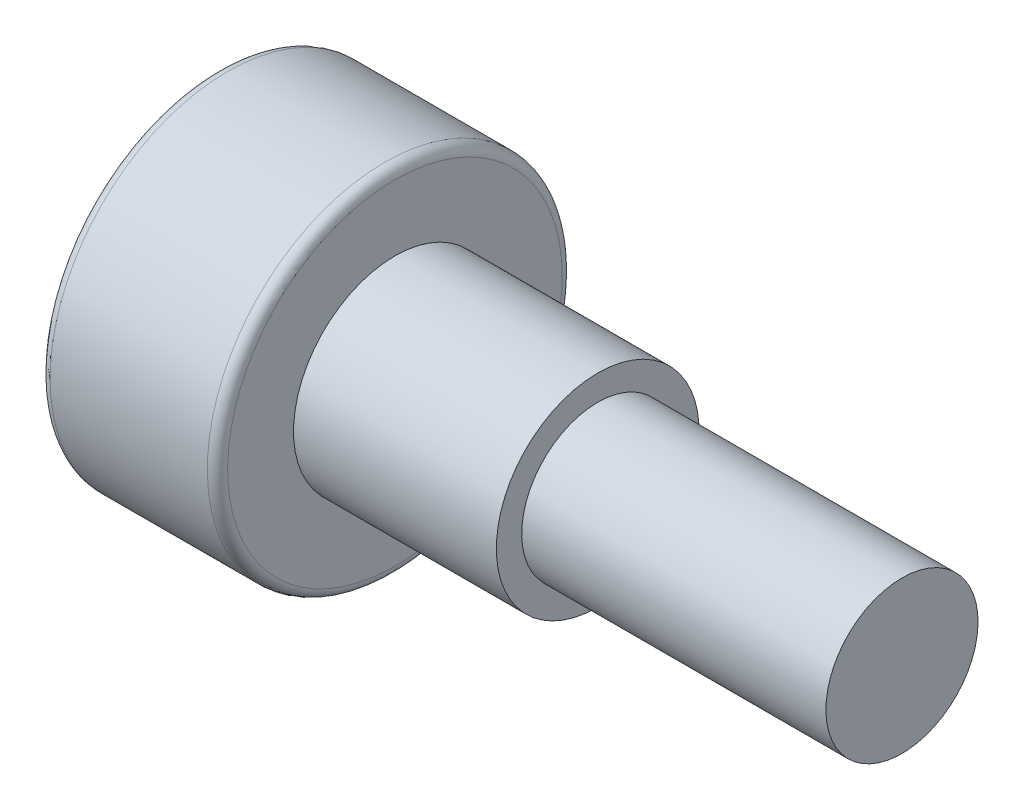
ISO-10303-21;
HEADER;
FILE_DESCRIPTION(('STEP AP214'),'2;1');
FILE_NAME('part.step','',(''),(''),'','','');
FILE_SCHEMA(('AUTOMOTIVE_DESIGN { 1 0 10303 214 1 1 1 1 }'));
ENDSEC;
DATA;
#1=APPLICATION_CONTEXT('core data for automotive mechanical design processes');
#2=APPLICATION_PROTOCOL_DEFINITION('international standard','automotive_design',2000,#1);
#3=PRODUCT_CONTEXT('',#1,'mechanical');
#4=PRODUCT('Part','Part','',(#3));
#5=PRODUCT_RELATED_PRODUCT_CATEGORY('part','',(#4));
#6=PRODUCT_DEFINITION_FORMATION('','',#4);
#7=PRODUCT_DEFINITION_CONTEXT('part definition',#1,'design');
#8=PRODUCT_DEFINITION('design','',#6,#7);
#9=PRODUCT_DEFINITION_SHAPE('','',#8);
#10=(LENGTH_UNIT() NAMED_UNIT(*) SI_UNIT(.MILLI.,.METRE.));
#11=(NAMED_UNIT(*) PLANE_ANGLE_UNIT() SI_UNIT($,.RADIAN.));
#12=(NAMED_UNIT(*) SI_UNIT($,.STERADIAN.) SOLID_ANGLE_UNIT());
#13=UNCERTAINTY_MEASURE_WITH_UNIT(LENGTH_MEASURE(1.E-05),#10,'distance_accuracy_value','');
#14=(GEOMETRIC_REPRESENTATION_CONTEXT(3) GLOBAL_UNCERTAINTY_ASSIGNED_CONTEXT((#13)) GLOBAL_UNIT_ASSIGNED_CONTEXT((#10,
#11,#12)) REPRESENTATION_CONTEXT('',''));
#15=CARTESIAN_POINT('',(0.,0.,0.));
#16=DIRECTION('',(0.,0.,1.));
#17=DIRECTION('',(1.,0.,0.));
#18=AXIS2_PLACEMENT_3D('',#15,#16,#17);
#19=CARTESIAN_POINT('',(0.,0.,0.));
#20=DIRECTION('',(-1.,0.,0.));
#21=DIRECTION('',(0.,-1.,0.));
#22=AXIS2_PLACEMENT_3D('',#19,#20,#21);
#23=PLANE('',#22);
#24=CARTESIAN_POINT('',(0.,0.,0.));
#25=DIRECTION('',(-1.,0.,0.));
#26=DIRECTION('',(0.,-1.,0.));
#27=AXIS2_PLACEMENT_3D('',#24,#25,#26);
#28=CIRCLE('',#27,3.3);
#29=CARTESIAN_POINT('',(0.,-3.3,0.));
#30=VERTEX_POINT('',#29);
#31=EDGE_CURVE('E47',#30,#30,#28,.T.);
#32=ORIENTED_EDGE('',*,*,#31,.T.);
#33=EDGE_LOOP('',(#32));
#34=FACE_BOUND('',#33,.T.);
#35=DIRECTION('',(0.,1.,0.));
#36=VECTOR('',#35,1.);
#37=CARTESIAN_POINT('',(0.,-0.866025403784439,1.5));
#38=LINE('',#37,#36);
#39=CARTESIAN_POINT('',(0.,-0.866025403784439,1.5));
#40=VERTEX_POINT('',#39);
#41=CARTESIAN_POINT('',(0.,0.866025403784439,1.5));
#42=VERTEX_POINT('',#41);
#43=EDGE_CURVE('E54',#40,#42,#38,.T.);
#44=ORIENTED_EDGE('',*,*,#43,.F.);
#45=DIRECTION('',(0.,0.5,0.866025403784439));
#46=VECTOR('',#45,1.);
#47=CARTESIAN_POINT('',(0.,-1.73205080756888,0.));
#48=LINE('',#47,#46);
#49=CARTESIAN_POINT('',(0.,-1.73205080756888,0.));
#50=VERTEX_POINT('',#49);
#51=EDGE_CURVE('E137',#50,#40,#48,.T.);
#52=ORIENTED_EDGE('',*,*,#51,.F.);
#53=DIRECTION('',(0.,-0.5,0.866025403784439));
#54=VECTOR('',#53,1.);
#55=CARTESIAN_POINT('',(0.,-0.866025403784438,-1.5));
#56=LINE('',#55,#54);
#57=CARTESIAN_POINT('',(0.,-0.866025403784438,-1.5));
#58=VERTEX_POINT('',#57);
#59=EDGE_CURVE('E135',#58,#50,#56,.T.);
#60=ORIENTED_EDGE('',*,*,#59,.F.);
#61=DIRECTION('',(0.,-1.,0.));
#62=VECTOR('',#61,1.);
#63=CARTESIAN_POINT('',(0.,0.866025403784439,-1.5));
#64=LINE('',#63,#62);
#65=CARTESIAN_POINT('',(0.,0.866025403784439,-1.5));
#66=VERTEX_POINT('',#65);
#67=EDGE_CURVE('E102',#66,#58,#64,.T.);
#68=ORIENTED_EDGE('',*,*,#67,.F.);
#69=DIRECTION('',(0.,-0.5,-0.866025403784439));
#70=VECTOR('',#69,1.);
#71=CARTESIAN_POINT('',(0.,1.73205080756888,0.));
#72=LINE('',#71,#70);
#73=CARTESIAN_POINT('',(0.,1.73205080756888,0.));
#74=VERTEX_POINT('',#73);
#75=EDGE_CURVE('E131',#74,#66,#72,.T.);
#76=ORIENTED_EDGE('',*,*,#75,.F.);
#77=DIRECTION('',(0.,0.5,-0.866025403784439));
#78=VECTOR('',#77,1.);
#79=CARTESIAN_POINT('',(0.,0.866025403784439,1.5));
#80=LINE('',#79,#78);
#81=EDGE_CURVE('E128',#42,#74,#80,.T.);
#82=ORIENTED_EDGE('',*,*,#81,.F.);
#83=EDGE_LOOP('',(#44,#52,#60,#68,#76,#82));
#84=FACE_BOUND('',#83,.T.);
#85=ADVANCED_FACE('F39',(#34,#84),#23,.T.);
#86=CARTESIAN_POINT('',(13.5,0.,0.));
#87=DIRECTION('',(1.,0.,0.));
#88=DIRECTION('',(0.,1.,0.));
#89=AXIS2_PLACEMENT_3D('',#86,#87,#88);
#90=CYLINDRICAL_SURFACE('',#89,3.5);
#91=CARTESIAN_POINT('',(0.200000000000001,0.,0.));
#92=DIRECTION('',(-1.,0.,0.));
#93=DIRECTION('',(0.,-1.,0.));
#94=AXIS2_PLACEMENT_3D('',#91,#92,#93);
#95=CIRCLE('',#94,3.5);
#96=CARTESIAN_POINT('',(0.200000000000001,-3.5,0.));
#97=VERTEX_POINT('',#96);
#98=EDGE_CURVE('E161',#97,#97,#95,.F.);
#99=ORIENTED_EDGE('',*,*,#98,.T.);
#100=EDGE_LOOP('',(#99));
#101=FACE_BOUND('',#100,.T.);
#102=CARTESIAN_POINT('',(3.3,0.,0.));
#103=DIRECTION('',(1.,0.,0.));
#104=DIRECTION('',(0.,1.,0.));
#105=AXIS2_PLACEMENT_3D('',#102,#103,#104);
#106=CIRCLE('',#105,3.5);
#107=CARTESIAN_POINT('',(3.3,3.5,0.));
#108=VERTEX_POINT('',#107);
#109=EDGE_CURVE('E158',#108,#108,#106,.F.);
#110=ORIENTED_EDGE('',*,*,#109,.T.);
#111=EDGE_LOOP('',(#110));
#112=FACE_BOUND('',#111,.T.);
#113=ADVANCED_FACE('F173',(#101,#112),#90,.T.);
#114=CARTESIAN_POINT('',(3.5,3.5,0.));
#115=DIRECTION('',(1.,0.,0.));
#116=DIRECTION('',(0.,1.,0.));
#117=AXIS2_PLACEMENT_3D('',#114,#115,#116);
#118=PLANE('',#117);
#119=CARTESIAN_POINT('',(3.5,0.,0.));
#120=DIRECTION('',(1.,0.,0.));
#121=DIRECTION('',(0.,1.,0.));
#122=AXIS2_PLACEMENT_3D('',#119,#120,#121);
#123=CIRCLE('',#122,3.3);
#124=CARTESIAN_POINT('',(3.5,3.3,0.));
#125=VERTEX_POINT('',#124);
#126=EDGE_CURVE('E11',#125,#125,#123,.T.);
#127=ORIENTED_EDGE('',*,*,#126,.T.);
#128=EDGE_LOOP('',(#127));
#129=FACE_BOUND('',#128,.T.);
#130=CARTESIAN_POINT('',(3.5,0.,0.));
#131=DIRECTION('',(1.,0.,0.));
#132=DIRECTION('',(0.,1.,0.));
#133=AXIS2_PLACEMENT_3D('',#130,#131,#132);
#134=CIRCLE('',#133,2.);
#135=CARTESIAN_POINT('',(3.5,2.,0.));
#136=VERTEX_POINT('',#135);
#137=EDGE_CURVE('E155',#136,#136,#134,.T.);
#138=ORIENTED_EDGE('',*,*,#137,.F.);
#139=EDGE_LOOP('',(#138));
#140=FACE_BOUND('',#139,.T.);
#141=ADVANCED_FACE('F176',(#129,#140),#118,.T.);
#142=CARTESIAN_POINT('',(13.5,0.,0.));
#143=DIRECTION('',(1.,0.,0.));
#144=DIRECTION('',(0.,1.,0.));
#145=AXIS2_PLACEMENT_3D('',#142,#143,#144);
#146=CYLINDRICAL_SURFACE('',#145,2.);
#147=ORIENTED_EDGE('',*,*,#137,.T.);
#148=EDGE_LOOP('',(#147));
#149=FACE_BOUND('',#148,.T.);
#150=CARTESIAN_POINT('',(7.5,0.,0.));
#151=DIRECTION('',(1.,0.,0.));
#152=DIRECTION('',(0.,1.,0.));
#153=AXIS2_PLACEMENT_3D('',#150,#151,#152);
#154=CIRCLE('',#153,2.);
#155=CARTESIAN_POINT('',(7.5,2.,0.));
#156=VERTEX_POINT('',#155);
#157=EDGE_CURVE('E152',#156,#156,#154,.T.);
#158=ORIENTED_EDGE('',*,*,#157,.F.);
#159=EDGE_LOOP('',(#158));
#160=FACE_BOUND('',#159,.T.);
#161=ADVANCED_FACE('F186',(#149,#160),#146,.T.);
#162=CARTESIAN_POINT('',(7.5,2.,0.));
#163=DIRECTION('',(1.,0.,0.));
#164=DIRECTION('',(0.,1.,0.));
#165=AXIS2_PLACEMENT_3D('',#162,#163,#164);
#166=PLANE('',#165);
#167=ORIENTED_EDGE('',*,*,#157,.T.);
#168=EDGE_LOOP('',(#167));
#169=FACE_BOUND('',#168,.T.);
#170=CARTESIAN_POINT('',(7.5,0.,0.));
#171=DIRECTION('',(1.,0.,0.));
#172=DIRECTION('',(0.,1.,0.));
#173=AXIS2_PLACEMENT_3D('',#170,#171,#172);
#174=CIRCLE('',#173,1.5);
#175=CARTESIAN_POINT('',(7.5,1.5,0.));
#176=VERTEX_POINT('',#175);
#177=EDGE_CURVE('E149',#176,#176,#174,.T.);
#178=ORIENTED_EDGE('',*,*,#177,.F.);
#179=EDGE_LOOP('',(#178));
#180=FACE_BOUND('',#179,.T.);
#181=ADVANCED_FACE('F192',(#169,#180),#166,.T.);
#182=CARTESIAN_POINT('',(13.5,0.,0.));
#183=DIRECTION('',(1.,0.,0.));
#184=DIRECTION('',(0.,1.,0.));
#185=AXIS2_PLACEMENT_3D('',#182,#183,#184);
#186=CYLINDRICAL_SURFACE('',#185,1.5);
#187=ORIENTED_EDGE('',*,*,#177,.T.);
#188=EDGE_LOOP('',(#187));
#189=FACE_BOUND('',#188,.T.);
#190=CARTESIAN_POINT('',(13.5,0.,0.));
#191=DIRECTION('',(1.,0.,0.));
#192=DIRECTION('',(0.,1.,0.));
#193=AXIS2_PLACEMENT_3D('',#190,#191,#192);
#194=CIRCLE('',#193,1.5);
#195=CARTESIAN_POINT('',(13.5,1.5,0.));
#196=VERTEX_POINT('',#195);
#197=EDGE_CURVE('E141',#196,#196,#194,.T.);
#198=ORIENTED_EDGE('',*,*,#197,.F.);
#199=EDGE_LOOP('',(#198));
#200=FACE_BOUND('',#199,.T.);
#201=ADVANCED_FACE('F198',(#189,#200),#186,.T.);
#202=CARTESIAN_POINT('',(13.5,1.5,0.));
#203=DIRECTION('',(1.,0.,0.));
#204=DIRECTION('',(0.,1.,0.));
#205=AXIS2_PLACEMENT_3D('',#202,#203,#204);
#206=PLANE('',#205);
#207=ORIENTED_EDGE('',*,*,#197,.T.);
#208=EDGE_LOOP('',(#207));
#209=FACE_BOUND('',#208,.T.);
#210=ADVANCED_FACE('F204',(#209),#206,.T.);
#211=CARTESIAN_POINT('',(2.,-0.866025403784439,1.5));
#212=DIRECTION('',(0.,0.,1.));
#213=DIRECTION('',(1.,0.,0.));
#214=AXIS2_PLACEMENT_3D('',#211,#212,#213);
#215=PLANE('',#214);
#216=ORIENTED_EDGE('',*,*,#43,.T.);
#217=DIRECTION('',(-1.,0.,0.));
#218=VECTOR('',#217,1.);
#219=CARTESIAN_POINT('',(2.,0.866025403784439,1.5));
#220=LINE('',#219,#218);
#221=CARTESIAN_POINT('',(2.,0.866025403784439,1.5));
#222=VERTEX_POINT('',#221);
#223=EDGE_CURVE('E84',#222,#42,#220,.T.);
#224=ORIENTED_EDGE('',*,*,#223,.F.);
#225=DIRECTION('',(0.,1.,0.));
#226=VECTOR('',#225,1.);
#227=CARTESIAN_POINT('',(2.,-0.866025403784439,1.5));
#228=LINE('',#227,#226);
#229=CARTESIAN_POINT('',(2.,-0.866025403784439,1.5));
#230=VERTEX_POINT('',#229);
#231=EDGE_CURVE('E139',#230,#222,#228,.T.);
#232=ORIENTED_EDGE('',*,*,#231,.F.);
#233=DIRECTION('',(-1.,0.,0.));
#234=VECTOR('',#233,1.);
#235=CARTESIAN_POINT('',(2.,-0.866025403784439,1.5));
#236=LINE('',#235,#234);
#237=EDGE_CURVE('E62',#230,#40,#236,.T.);
#238=ORIENTED_EDGE('',*,*,#237,.T.);
#239=EDGE_LOOP('',(#216,#224,#232,#238));
#240=FACE_BOUND('',#239,.T.);
#241=ADVANCED_FACE('F209',(#240),#215,.F.);
#242=CARTESIAN_POINT('',(2.,-1.73205080756888,0.));
#243=DIRECTION('',(0.,-0.866025403784439,0.5));
#244=DIRECTION('',(0.,-0.5,-0.866025403784439));
#245=AXIS2_PLACEMENT_3D('',#242,#243,#244);
#246=PLANE('',#245);
#247=ORIENTED_EDGE('',*,*,#51,.T.);
#248=ORIENTED_EDGE('',*,*,#237,.F.);
#249=DIRECTION('',(0.,0.5,0.866025403784439));
#250=VECTOR('',#249,1.);
#251=CARTESIAN_POINT('',(2.,-1.73205080756888,0.));
#252=LINE('',#251,#250);
#253=CARTESIAN_POINT('',(2.,-1.73205080756888,0.));
#254=VERTEX_POINT('',#253);
#255=EDGE_CURVE('E114',#254,#230,#252,.T.);
#256=ORIENTED_EDGE('',*,*,#255,.F.);
#257=DIRECTION('',(-1.,0.,0.));
#258=VECTOR('',#257,1.);
#259=CARTESIAN_POINT('',(2.,-1.73205080756888,0.));
#260=LINE('',#259,#258);
#261=EDGE_CURVE('E106',#254,#50,#260,.T.);
#262=ORIENTED_EDGE('',*,*,#261,.T.);
#263=EDGE_LOOP('',(#247,#248,#256,#262));
#264=FACE_BOUND('',#263,.T.);
#265=ADVANCED_FACE('F214',(#264),#246,.F.);
#266=CARTESIAN_POINT('',(2.,-0.866025403784438,-1.5));
#267=DIRECTION('',(0.,-0.866025403784439,-0.5));
#268=DIRECTION('',(0.,0.5,-0.866025403784439));
#269=AXIS2_PLACEMENT_3D('',#266,#267,#268);
#270=PLANE('',#269);
#271=ORIENTED_EDGE('',*,*,#59,.T.);
#272=ORIENTED_EDGE('',*,*,#261,.F.);
#273=DIRECTION('',(0.,-0.5,0.866025403784439));
#274=VECTOR('',#273,1.);
#275=CARTESIAN_POINT('',(2.,-0.866025403784438,-1.5));
#276=LINE('',#275,#274);
#277=CARTESIAN_POINT('',(2.,-0.866025403784438,-1.5));
#278=VERTEX_POINT('',#277);
#279=EDGE_CURVE('E110',#278,#254,#276,.T.);
#280=ORIENTED_EDGE('',*,*,#279,.F.);
#281=DIRECTION('',(-1.,0.,0.));
#282=VECTOR('',#281,1.);
#283=CARTESIAN_POINT('',(2.,-0.866025403784438,-1.5));
#284=LINE('',#283,#282);
#285=EDGE_CURVE('E95',#278,#58,#284,.T.);
#286=ORIENTED_EDGE('',*,*,#285,.T.);
#287=EDGE_LOOP('',(#271,#272,#280,#286));
#288=FACE_BOUND('',#287,.T.);
#289=ADVANCED_FACE('F111',(#288),#270,.F.);
#290=CARTESIAN_POINT('',(2.,0.866025403784439,-1.5));
#291=DIRECTION('',(0.,0.,-1.));
#292=DIRECTION('',(0.,1.,0.));
#293=AXIS2_PLACEMENT_3D('',#290,#291,#292);
#294=PLANE('',#293);
#295=ORIENTED_EDGE('',*,*,#67,.T.);
#296=ORIENTED_EDGE('',*,*,#285,.F.);
#297=DIRECTION('',(0.,-1.,0.));
#298=VECTOR('',#297,1.);
#299=CARTESIAN_POINT('',(2.,0.866025403784439,-1.5));
#300=LINE('',#299,#298);
#301=CARTESIAN_POINT('',(2.,0.866025403784439,-1.5));
#302=VERTEX_POINT('',#301);
#303=EDGE_CURVE('E99',#302,#278,#300,.T.);
#304=ORIENTED_EDGE('',*,*,#303,.F.);
#305=DIRECTION('',(-1.,0.,0.));
#306=VECTOR('',#305,1.);
#307=CARTESIAN_POINT('',(2.,0.866025403784439,-1.5));
#308=LINE('',#307,#306);
#309=EDGE_CURVE('E107',#302,#66,#308,.T.);
#310=ORIENTED_EDGE('',*,*,#309,.T.);
#311=EDGE_LOOP('',(#295,#296,#304,#310));
#312=FACE_BOUND('',#311,.T.);
#313=ADVANCED_FACE('F97',(#312),#294,.F.);
#314=CARTESIAN_POINT('',(2.,1.73205080756888,0.));
#315=DIRECTION('',(0.,0.866025403784439,-0.5));
#316=DIRECTION('',(0.,0.5,0.866025403784439));
#317=AXIS2_PLACEMENT_3D('',#314,#315,#316);
#318=PLANE('',#317);
#319=ORIENTED_EDGE('',*,*,#75,.T.);
#320=ORIENTED_EDGE('',*,*,#309,.F.);
#321=DIRECTION('',(0.,-0.5,-0.866025403784439));
#322=VECTOR('',#321,1.);
#323=CARTESIAN_POINT('',(2.,1.73205080756888,0.));
#324=LINE('',#323,#322);
#325=CARTESIAN_POINT('',(2.,1.73205080756888,0.));
#326=VERTEX_POINT('',#325);
#327=EDGE_CURVE('E120',#326,#302,#324,.T.);
#328=ORIENTED_EDGE('',*,*,#327,.F.);
#329=DIRECTION('',(-1.,0.,0.));
#330=VECTOR('',#329,1.);
#331=CARTESIAN_POINT('',(2.,1.73205080756888,0.));
#332=LINE('',#331,#330);
#333=EDGE_CURVE('E144',#326,#74,#332,.T.);
#334=ORIENTED_EDGE('',*,*,#333,.T.);
#335=EDGE_LOOP('',(#319,#320,#328,#334));
#336=FACE_BOUND('',#335,.T.);
#337=ADVANCED_FACE('F285',(#336),#318,.F.);
#338=CARTESIAN_POINT('',(2.,0.866025403784439,1.5));
#339=DIRECTION('',(0.,0.866025403784439,0.5));
#340=DIRECTION('',(0.,-0.5,0.866025403784439));
#341=AXIS2_PLACEMENT_3D('',#338,#339,#340);
#342=PLANE('',#341);
#343=ORIENTED_EDGE('',*,*,#81,.T.);
#344=ORIENTED_EDGE('',*,*,#333,.F.);
#345=DIRECTION('',(0.,0.5,-0.866025403784439));
#346=VECTOR('',#345,1.);
#347=CARTESIAN_POINT('',(2.,0.866025403784439,1.5));
#348=LINE('',#347,#346);
#349=EDGE_CURVE('E122',#222,#326,#348,.T.);
#350=ORIENTED_EDGE('',*,*,#349,.F.);
#351=ORIENTED_EDGE('',*,*,#223,.T.);
#352=EDGE_LOOP('',(#343,#344,#350,#351));
#353=FACE_BOUND('',#352,.T.);
#354=ADVANCED_FACE('F293',(#353),#342,.F.);
#355=CARTESIAN_POINT('',(2.,0.,0.));
#356=DIRECTION('',(-1.,0.,0.));
#357=DIRECTION('',(0.,-1.,0.));
#358=AXIS2_PLACEMENT_3D('',#355,#356,#357);
#359=PLANE('',#358);
#360=ORIENTED_EDGE('',*,*,#231,.T.);
#361=ORIENTED_EDGE('',*,*,#349,.T.);
#362=ORIENTED_EDGE('',*,*,#327,.T.);
#363=ORIENTED_EDGE('',*,*,#303,.T.);
#364=ORIENTED_EDGE('',*,*,#279,.T.);
#365=ORIENTED_EDGE('',*,*,#255,.T.);
#366=EDGE_LOOP('',(#360,#361,#362,#363,#364,#365));
#367=FACE_BOUND('',#366,.T.);
#368=ADVANCED_FACE('F117',(#367),#359,.T.);
#369=CARTESIAN_POINT('',(0.200000000000001,0.,0.));
#370=DIRECTION('',(-1.,0.,0.));
#371=DIRECTION('',(0.,-1.,0.));
#372=AXIS2_PLACEMENT_3D('',#369,#370,#371);
#373=TOROIDAL_SURFACE('',#372,3.3,0.2);
#374=ORIENTED_EDGE('',*,*,#31,.F.);
#375=EDGE_LOOP('',(#374));
#376=FACE_BOUND('',#375,.T.);
#377=ORIENTED_EDGE('',*,*,#98,.F.);
#378=EDGE_LOOP('',(#377));
#379=FACE_BOUND('',#378,.T.);
#380=ADVANCED_FACE('F168',(#376,#379),#373,.T.);
#381=CARTESIAN_POINT('',(3.3,0.,0.));
#382=DIRECTION('',(1.,0.,0.));
#383=DIRECTION('',(0.,1.,0.));
#384=AXIS2_PLACEMENT_3D('',#381,#382,#383);
#385=TOROIDAL_SURFACE('',#384,3.3,0.2);
#386=ORIENTED_EDGE('',*,*,#109,.F.);
#387=EDGE_LOOP('',(#386));
#388=FACE_BOUND('',#387,.T.);
#389=ORIENTED_EDGE('',*,*,#126,.F.);
#390=EDGE_LOOP('',(#389));
#391=FACE_BOUND('',#390,.T.);
#392=ADVANCED_FACE('F41',(#388,#391),#385,.T.);
#393=CLOSED_SHELL('',(#85,#113,#141,#161,#181,#201,#210,#241,#265,#289,#313,#337,#354,#368,#380,#392));
#394=MANIFOLD_SOLID_BREP('B2',#393);
#395=ADVANCED_BREP_SHAPE_REPRESENTATION('',(#18,#394),#14);
#396=SHAPE_DEFINITION_REPRESENTATION(#9,#395);
ENDSEC;
END-ISO-10303-21;
